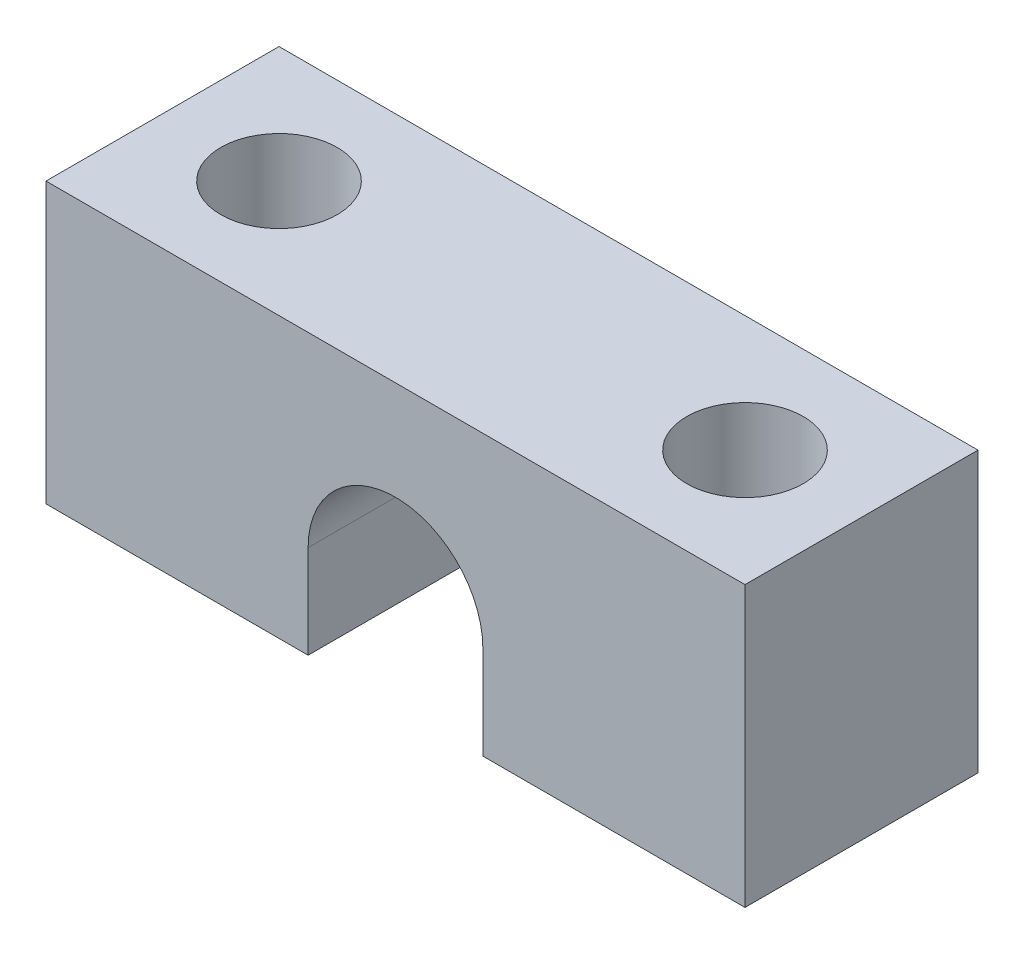
ISO-10303-21;
HEADER;
FILE_DESCRIPTION(('STEP AP214'),'2;1');
FILE_NAME('part.step','',(''),(''),'','','');
FILE_SCHEMA(('AUTOMOTIVE_DESIGN { 1 0 10303 214 1 1 1 1 }'));
ENDSEC;
DATA;
#1=APPLICATION_CONTEXT('core data for automotive mechanical design processes');
#2=APPLICATION_PROTOCOL_DEFINITION('international standard','automotive_design',2000,#1);
#3=PRODUCT_CONTEXT('',#1,'mechanical');
#4=PRODUCT('Part','Part','',(#3));
#5=PRODUCT_RELATED_PRODUCT_CATEGORY('part','',(#4));
#6=PRODUCT_DEFINITION_FORMATION('','',#4);
#7=PRODUCT_DEFINITION_CONTEXT('part definition',#1,'design');
#8=PRODUCT_DEFINITION('design','',#6,#7);
#9=PRODUCT_DEFINITION_SHAPE('','',#8);
#10=(LENGTH_UNIT() NAMED_UNIT(*) SI_UNIT(.MILLI.,.METRE.));
#11=(NAMED_UNIT(*) PLANE_ANGLE_UNIT() SI_UNIT($,.RADIAN.));
#12=(NAMED_UNIT(*) SI_UNIT($,.STERADIAN.) SOLID_ANGLE_UNIT());
#13=UNCERTAINTY_MEASURE_WITH_UNIT(LENGTH_MEASURE(1.E-05),#10,'distance_accuracy_value','');
#14=(GEOMETRIC_REPRESENTATION_CONTEXT(3) GLOBAL_UNCERTAINTY_ASSIGNED_CONTEXT((#13)) GLOBAL_UNIT_ASSIGNED_CONTEXT((#10,
#11,#12)) REPRESENTATION_CONTEXT('',''));
#15=CARTESIAN_POINT('',(0.,0.,0.));
#16=DIRECTION('',(0.,0.,1.));
#17=DIRECTION('',(1.,0.,0.));
#18=AXIS2_PLACEMENT_3D('',#15,#16,#17);
#19=CARTESIAN_POINT('',(-20.,0.,0.));
#20=DIRECTION('',(0.,1.,0.));
#21=DIRECTION('',(0.,0.,1.));
#22=AXIS2_PLACEMENT_3D('',#19,#20,#21);
#23=CYLINDRICAL_SURFACE('',#22,5.);
#24=CARTESIAN_POINT('',(-20.,24.,0.));
#25=DIRECTION('',(0.,1.,0.));
#26=DIRECTION('',(0.,0.,1.));
#27=AXIS2_PLACEMENT_3D('',#24,#25,#26);
#28=CIRCLE('',#27,5.);
#29=CARTESIAN_POINT('',(-20.,24.,5.));
#30=VERTEX_POINT('',#29);
#31=EDGE_CURVE('E146',#30,#30,#28,.F.);
#32=ORIENTED_EDGE('',*,*,#31,.F.);
#33=EDGE_LOOP('',(#32));
#34=FACE_BOUND('',#33,.T.);
#35=CARTESIAN_POINT('',(-20.,0.,0.));
#36=DIRECTION('',(0.,1.,0.));
#37=DIRECTION('',(0.,0.,1.));
#38=AXIS2_PLACEMENT_3D('',#35,#36,#37);
#39=CIRCLE('',#38,5.);
#40=CARTESIAN_POINT('',(-20.,0.,5.));
#41=VERTEX_POINT('',#40);
#42=EDGE_CURVE('E131',#41,#41,#39,.F.);
#43=ORIENTED_EDGE('',*,*,#42,.T.);
#44=EDGE_LOOP('',(#43));
#45=FACE_BOUND('',#44,.T.);
#46=ADVANCED_FACE('F16',(#34,#45),#23,.F.);
#47=CARTESIAN_POINT('',(20.,0.,0.));
#48=DIRECTION('',(0.,1.,0.));
#49=DIRECTION('',(0.,0.,1.));
#50=AXIS2_PLACEMENT_3D('',#47,#48,#49);
#51=CYLINDRICAL_SURFACE('',#50,5.);
#52=CARTESIAN_POINT('',(20.,24.,0.));
#53=DIRECTION('',(0.,1.,0.));
#54=DIRECTION('',(0.,0.,1.));
#55=AXIS2_PLACEMENT_3D('',#52,#53,#54);
#56=CIRCLE('',#55,5.);
#57=CARTESIAN_POINT('',(20.,24.,5.));
#58=VERTEX_POINT('',#57);
#59=EDGE_CURVE('E143',#58,#58,#56,.F.);
#60=ORIENTED_EDGE('',*,*,#59,.F.);
#61=EDGE_LOOP('',(#60));
#62=FACE_BOUND('',#61,.T.);
#63=CARTESIAN_POINT('',(20.,0.,0.));
#64=DIRECTION('',(0.,1.,0.));
#65=DIRECTION('',(0.,0.,1.));
#66=AXIS2_PLACEMENT_3D('',#63,#64,#65);
#67=CIRCLE('',#66,5.);
#68=CARTESIAN_POINT('',(20.,0.,5.));
#69=VERTEX_POINT('',#68);
#70=EDGE_CURVE('E140',#69,#69,#67,.F.);
#71=ORIENTED_EDGE('',*,*,#70,.T.);
#72=EDGE_LOOP('',(#71));
#73=FACE_BOUND('',#72,.T.);
#74=ADVANCED_FACE('F243',(#62,#73),#51,.F.);
#75=CARTESIAN_POINT('',(-30.,0.,10.));
#76=DIRECTION('',(0.,0.,1.));
#77=DIRECTION('',(1.,0.,0.));
#78=AXIS2_PLACEMENT_3D('',#75,#76,#77);
#79=PLANE('',#78);
#80=CARTESIAN_POINT('',(0.,8.00000000000001,10.));
#81=DIRECTION('',(0.,0.,1.));
#82=DIRECTION('',(1.,0.,0.));
#83=AXIS2_PLACEMENT_3D('',#80,#81,#82);
#84=CIRCLE('',#83,7.5);
#85=CARTESIAN_POINT('',(-7.49999999999999,8.00000000000001,10.));
#86=VERTEX_POINT('',#85);
#87=CARTESIAN_POINT('',(7.50000000000001,8.00000000000001,10.));
#88=VERTEX_POINT('',#87);
#89=EDGE_CURVE('E19',#86,#88,#84,.F.);
#90=ORIENTED_EDGE('',*,*,#89,.T.);
#91=DIRECTION('',(0.,1.,0.));
#92=VECTOR('',#91,1.);
#93=CARTESIAN_POINT('',(7.50000000000001,0.,10.));
#94=LINE('',#93,#92);
#95=CARTESIAN_POINT('',(7.50000000000001,0.,10.));
#96=VERTEX_POINT('',#95);
#97=EDGE_CURVE('E106',#88,#96,#94,.F.);
#98=ORIENTED_EDGE('',*,*,#97,.T.);
#99=DIRECTION('',(1.,0.,0.));
#100=VECTOR('',#99,1.);
#101=CARTESIAN_POINT('',(0.,0.,10.));
#102=LINE('',#101,#100);
#103=CARTESIAN_POINT('',(30.,0.,10.0000000000002));
#104=VERTEX_POINT('',#103);
#105=EDGE_CURVE('E111',#96,#104,#102,.T.);
#106=ORIENTED_EDGE('',*,*,#105,.T.);
#107=DIRECTION('',(0.,1.,0.));
#108=VECTOR('',#107,1.);
#109=CARTESIAN_POINT('',(30.,0.,10.0000000000002));
#110=LINE('',#109,#108);
#111=CARTESIAN_POINT('',(30.,24.,10.0000000000002));
#112=VERTEX_POINT('',#111);
#113=EDGE_CURVE('E114',#112,#104,#110,.F.);
#114=ORIENTED_EDGE('',*,*,#113,.F.);
#115=DIRECTION('',(1.,0.,0.));
#116=VECTOR('',#115,1.);
#117=CARTESIAN_POINT('',(0.,24.,10.));
#118=LINE('',#117,#116);
#119=CARTESIAN_POINT('',(-30.,24.,10.));
#120=VERTEX_POINT('',#119);
#121=EDGE_CURVE('E122',#120,#112,#118,.T.);
#122=ORIENTED_EDGE('',*,*,#121,.F.);
#123=DIRECTION('',(0.,1.,0.));
#124=VECTOR('',#123,1.);
#125=CARTESIAN_POINT('',(-30.,0.,10.));
#126=LINE('',#125,#124);
#127=CARTESIAN_POINT('',(-30.,0.,10.));
#128=VERTEX_POINT('',#127);
#129=EDGE_CURVE('E128',#128,#120,#126,.T.);
#130=ORIENTED_EDGE('',*,*,#129,.F.);
#131=DIRECTION('',(1.,0.,0.));
#132=VECTOR('',#131,1.);
#133=CARTESIAN_POINT('',(0.,0.,10.));
#134=LINE('',#133,#132);
#135=CARTESIAN_POINT('',(-7.49999999999999,0.,10.));
#136=VERTEX_POINT('',#135);
#137=EDGE_CURVE('E84',#128,#136,#134,.T.);
#138=ORIENTED_EDGE('',*,*,#137,.T.);
#139=DIRECTION('',(0.,1.,0.));
#140=VECTOR('',#139,1.);
#141=CARTESIAN_POINT('',(-7.49999999999999,8.00000000000001,10.));
#142=LINE('',#141,#140);
#143=EDGE_CURVE('E78',#136,#86,#142,.T.);
#144=ORIENTED_EDGE('',*,*,#143,.T.);
#145=EDGE_LOOP('',(#90,#98,#106,#114,#122,#130,#138,#144));
#146=FACE_BOUND('',#145,.T.);
#147=ADVANCED_FACE('F80',(#146),#79,.T.);
#148=CARTESIAN_POINT('',(0.,8.00000000000001,10.));
#149=DIRECTION('',(0.,0.,1.));
#150=DIRECTION('',(1.,0.,0.));
#151=AXIS2_PLACEMENT_3D('',#148,#149,#150);
#152=CYLINDRICAL_SURFACE('',#151,7.5);
#153=CARTESIAN_POINT('',(0.,8.00000000000001,-9.9999999999999));
#154=DIRECTION('',(0.,0.,1.));
#155=DIRECTION('',(1.,0.,0.));
#156=AXIS2_PLACEMENT_3D('',#153,#154,#155);
#157=CIRCLE('',#156,7.5);
#158=CARTESIAN_POINT('',(7.49999999999999,8.00000000000001,-9.9999999999999));
#159=VERTEX_POINT('',#158);
#160=CARTESIAN_POINT('',(-7.50000000000001,8.00000000000001,-9.9999999999999));
#161=VERTEX_POINT('',#160);
#162=EDGE_CURVE('E108',#159,#161,#157,.T.);
#163=ORIENTED_EDGE('',*,*,#162,.F.);
#164=DIRECTION('',(0.,0.,-1.));
#165=VECTOR('',#164,1.);
#166=CARTESIAN_POINT('',(7.50000000000001,8.00000000000001,10.));
#167=LINE('',#166,#165);
#168=EDGE_CURVE('E94',#159,#88,#167,.F.);
#169=ORIENTED_EDGE('',*,*,#168,.T.);
#170=ORIENTED_EDGE('',*,*,#89,.F.);
#171=DIRECTION('',(0.,0.,1.));
#172=VECTOR('',#171,1.);
#173=CARTESIAN_POINT('',(-7.49999999999999,8.00000000000001,10.));
#174=LINE('',#173,#172);
#175=EDGE_CURVE('E88',#86,#161,#174,.F.);
#176=ORIENTED_EDGE('',*,*,#175,.T.);
#177=EDGE_LOOP('',(#163,#169,#170,#176));
#178=FACE_BOUND('',#177,.T.);
#179=ADVANCED_FACE('F91',(#178),#152,.F.);
#180=CARTESIAN_POINT('',(-7.49999999999999,8.00000000000001,10.));
#181=DIRECTION('',(-1.,0.,0.));
#182=DIRECTION('',(0.,0.,1.));
#183=AXIS2_PLACEMENT_3D('',#180,#181,#182);
#184=PLANE('',#183);
#185=ORIENTED_EDGE('',*,*,#175,.F.);
#186=ORIENTED_EDGE('',*,*,#143,.F.);
#187=DIRECTION('',(0.,0.,1.));
#188=VECTOR('',#187,1.);
#189=CARTESIAN_POINT('',(-7.50000000000001,0.,0.));
#190=LINE('',#189,#188);
#191=CARTESIAN_POINT('',(-7.50000000000001,0.,-9.9999999999999));
#192=VERTEX_POINT('',#191);
#193=EDGE_CURVE('E100',#136,#192,#190,.F.);
#194=ORIENTED_EDGE('',*,*,#193,.T.);
#195=DIRECTION('',(0.,1.,0.));
#196=VECTOR('',#195,1.);
#197=CARTESIAN_POINT('',(-7.50000000000001,0.,-9.9999999999999));
#198=LINE('',#197,#196);
#199=EDGE_CURVE('E98',#161,#192,#198,.F.);
#200=ORIENTED_EDGE('',*,*,#199,.F.);
#201=EDGE_LOOP('',(#185,#186,#194,#200));
#202=FACE_BOUND('',#201,.T.);
#203=ADVANCED_FACE('F96',(#202),#184,.F.);
#204=CARTESIAN_POINT('',(0.,0.,0.));
#205=DIRECTION('',(0.,1.,0.));
#206=DIRECTION('',(0.,0.,1.));
#207=AXIS2_PLACEMENT_3D('',#204,#205,#206);
#208=PLANE('',#207);
#209=ORIENTED_EDGE('',*,*,#42,.F.);
#210=EDGE_LOOP('',(#209));
#211=FACE_BOUND('',#210,.T.);
#212=DIRECTION('',(0.,0.,1.));
#213=VECTOR('',#212,1.);
#214=CARTESIAN_POINT('',(-30.,0.,-9.99999999999999));
#215=LINE('',#214,#213);
#216=CARTESIAN_POINT('',(-30.,0.,-9.99999999999999));
#217=VERTEX_POINT('',#216);
#218=EDGE_CURVE('E125',#217,#128,#215,.T.);
#219=ORIENTED_EDGE('',*,*,#218,.F.);
#220=DIRECTION('',(-1.,0.,0.));
#221=VECTOR('',#220,1.);
#222=CARTESIAN_POINT('',(30.,0.,-10.));
#223=LINE('',#222,#221);
#224=EDGE_CURVE('E161',#192,#217,#223,.T.);
#225=ORIENTED_EDGE('',*,*,#224,.F.);
#226=ORIENTED_EDGE('',*,*,#193,.F.);
#227=ORIENTED_EDGE('',*,*,#137,.F.);
#228=EDGE_LOOP('',(#219,#225,#226,#227));
#229=FACE_BOUND('',#228,.T.);
#230=ADVANCED_FACE('F152',(#211,#229),#208,.F.);
#231=CARTESIAN_POINT('',(-30.,0.,-9.99999999999999));
#232=DIRECTION('',(-1.,0.,0.));
#233=DIRECTION('',(0.,0.,1.));
#234=AXIS2_PLACEMENT_3D('',#231,#232,#233);
#235=PLANE('',#234);
#236=DIRECTION('',(0.,1.,0.));
#237=VECTOR('',#236,1.);
#238=CARTESIAN_POINT('',(-30.,0.,-9.99999999999999));
#239=LINE('',#238,#237);
#240=CARTESIAN_POINT('',(-30.,24.,-9.99999999999999));
#241=VERTEX_POINT('',#240);
#242=EDGE_CURVE('E165',#217,#241,#239,.T.);
#243=ORIENTED_EDGE('',*,*,#242,.F.);
#244=ORIENTED_EDGE('',*,*,#218,.T.);
#245=ORIENTED_EDGE('',*,*,#129,.T.);
#246=DIRECTION('',(0.,0.,1.));
#247=VECTOR('',#246,1.);
#248=CARTESIAN_POINT('',(-30.,24.,0.));
#249=LINE('',#248,#247);
#250=EDGE_CURVE('E124',#241,#120,#249,.T.);
#251=ORIENTED_EDGE('',*,*,#250,.F.);
#252=EDGE_LOOP('',(#243,#244,#245,#251));
#253=FACE_BOUND('',#252,.T.);
#254=ADVANCED_FACE('F155',(#253),#235,.T.);
#255=CARTESIAN_POINT('',(0.,24.,0.));
#256=DIRECTION('',(0.,1.,0.));
#257=DIRECTION('',(0.,0.,1.));
#258=AXIS2_PLACEMENT_3D('',#255,#256,#257);
#259=PLANE('',#258);
#260=ORIENTED_EDGE('',*,*,#59,.T.);
#261=EDGE_LOOP('',(#260));
#262=FACE_BOUND('',#261,.T.);
#263=ORIENTED_EDGE('',*,*,#31,.T.);
#264=EDGE_LOOP('',(#263));
#265=FACE_BOUND('',#264,.T.);
#266=DIRECTION('',(-1.,0.,0.));
#267=VECTOR('',#266,1.);
#268=CARTESIAN_POINT('',(30.,24.,-10.));
#269=LINE('',#268,#267);
#270=CARTESIAN_POINT('',(30.,24.,-10.));
#271=VERTEX_POINT('',#270);
#272=EDGE_CURVE('E170',#241,#271,#269,.F.);
#273=ORIENTED_EDGE('',*,*,#272,.F.);
#274=ORIENTED_EDGE('',*,*,#250,.T.);
#275=ORIENTED_EDGE('',*,*,#121,.T.);
#276=DIRECTION('',(0.,0.,-1.));
#277=VECTOR('',#276,1.);
#278=CARTESIAN_POINT('',(30.,24.,10.0000000000002));
#279=LINE('',#278,#277);
#280=EDGE_CURVE('E119',#271,#112,#279,.F.);
#281=ORIENTED_EDGE('',*,*,#280,.F.);
#282=EDGE_LOOP('',(#273,#274,#275,#281));
#283=FACE_BOUND('',#282,.T.);
#284=ADVANCED_FACE('F232',(#262,#265,#283),#259,.T.);
#285=CARTESIAN_POINT('',(30.,0.,10.0000000000002));
#286=DIRECTION('',(1.,0.,0.));
#287=DIRECTION('',(0.,0.,-1.));
#288=AXIS2_PLACEMENT_3D('',#285,#286,#287);
#289=PLANE('',#288);
#290=ORIENTED_EDGE('',*,*,#113,.T.);
#291=DIRECTION('',(0.,0.,1.));
#292=VECTOR('',#291,1.);
#293=CARTESIAN_POINT('',(30.,0.,1.94289029309402E-13));
#294=LINE('',#293,#292);
#295=CARTESIAN_POINT('',(30.,0.,-10.));
#296=VERTEX_POINT('',#295);
#297=EDGE_CURVE('E113',#104,#296,#294,.F.);
#298=ORIENTED_EDGE('',*,*,#297,.T.);
#299=DIRECTION('',(0.,1.,0.));
#300=VECTOR('',#299,1.);
#301=CARTESIAN_POINT('',(30.,0.,-10.));
#302=LINE('',#301,#300);
#303=EDGE_CURVE('E189',#271,#296,#302,.F.);
#304=ORIENTED_EDGE('',*,*,#303,.F.);
#305=ORIENTED_EDGE('',*,*,#280,.T.);
#306=EDGE_LOOP('',(#290,#298,#304,#305));
#307=FACE_BOUND('',#306,.T.);
#308=ADVANCED_FACE('F215',(#307),#289,.T.);
#309=CARTESIAN_POINT('',(0.,0.,0.));
#310=DIRECTION('',(0.,1.,0.));
#311=DIRECTION('',(0.,0.,1.));
#312=AXIS2_PLACEMENT_3D('',#309,#310,#311);
#313=PLANE('',#312);
#314=ORIENTED_EDGE('',*,*,#70,.F.);
#315=EDGE_LOOP('',(#314));
#316=FACE_BOUND('',#315,.T.);
#317=ORIENTED_EDGE('',*,*,#297,.F.);
#318=ORIENTED_EDGE('',*,*,#105,.F.);
#319=DIRECTION('',(0.,0.,-1.));
#320=VECTOR('',#319,1.);
#321=CARTESIAN_POINT('',(7.50000000000001,0.,10.));
#322=LINE('',#321,#320);
#323=CARTESIAN_POINT('',(7.49999999999999,0.,-9.9999999999999));
#324=VERTEX_POINT('',#323);
#325=EDGE_CURVE('E34',#96,#324,#322,.T.);
#326=ORIENTED_EDGE('',*,*,#325,.T.);
#327=DIRECTION('',(-1.,0.,0.));
#328=VECTOR('',#327,1.);
#329=CARTESIAN_POINT('',(30.,0.,-10.));
#330=LINE('',#329,#328);
#331=EDGE_CURVE('E25',#296,#324,#330,.T.);
#332=ORIENTED_EDGE('',*,*,#331,.F.);
#333=EDGE_LOOP('',(#317,#318,#326,#332));
#334=FACE_BOUND('',#333,.T.);
#335=ADVANCED_FACE('F213',(#316,#334),#313,.F.);
#336=CARTESIAN_POINT('',(7.50000000000001,0.,10.));
#337=DIRECTION('',(1.,0.,0.));
#338=DIRECTION('',(0.,0.,-1.));
#339=AXIS2_PLACEMENT_3D('',#336,#337,#338);
#340=PLANE('',#339);
#341=ORIENTED_EDGE('',*,*,#168,.F.);
#342=DIRECTION('',(0.,1.,0.));
#343=VECTOR('',#342,1.);
#344=CARTESIAN_POINT('',(7.49999999999999,0.,-9.9999999999999));
#345=LINE('',#344,#343);
#346=EDGE_CURVE('E11',#324,#159,#345,.T.);
#347=ORIENTED_EDGE('',*,*,#346,.F.);
#348=ORIENTED_EDGE('',*,*,#325,.F.);
#349=ORIENTED_EDGE('',*,*,#97,.F.);
#350=EDGE_LOOP('',(#341,#347,#348,#349));
#351=FACE_BOUND('',#350,.T.);
#352=ADVANCED_FACE('F218',(#351),#340,.F.);
#353=CARTESIAN_POINT('',(30.,0.,-10.));
#354=DIRECTION('',(0.,0.,-1.));
#355=DIRECTION('',(-1.,0.,0.));
#356=AXIS2_PLACEMENT_3D('',#353,#354,#355);
#357=PLANE('',#356);
#358=ORIENTED_EDGE('',*,*,#331,.T.);
#359=ORIENTED_EDGE('',*,*,#346,.T.);
#360=ORIENTED_EDGE('',*,*,#162,.T.);
#361=ORIENTED_EDGE('',*,*,#199,.T.);
#362=ORIENTED_EDGE('',*,*,#224,.T.);
#363=ORIENTED_EDGE('',*,*,#242,.T.);
#364=ORIENTED_EDGE('',*,*,#272,.T.);
#365=ORIENTED_EDGE('',*,*,#303,.T.);
#366=EDGE_LOOP('',(#358,#359,#360,#361,#362,#363,#364,#365));
#367=FACE_BOUND('',#366,.T.);
#368=ADVANCED_FACE('F173',(#367),#357,.T.);
#369=CLOSED_SHELL('',(#46,#74,#147,#179,#203,#230,#254,#284,#308,#335,#352,#368));
#370=MANIFOLD_SOLID_BREP('B1',#369);
#371=ADVANCED_BREP_SHAPE_REPRESENTATION('',(#18,#370),#14);
#372=SHAPE_DEFINITION_REPRESENTATION(#9,#371);
ENDSEC;
END-ISO-10303-21;
